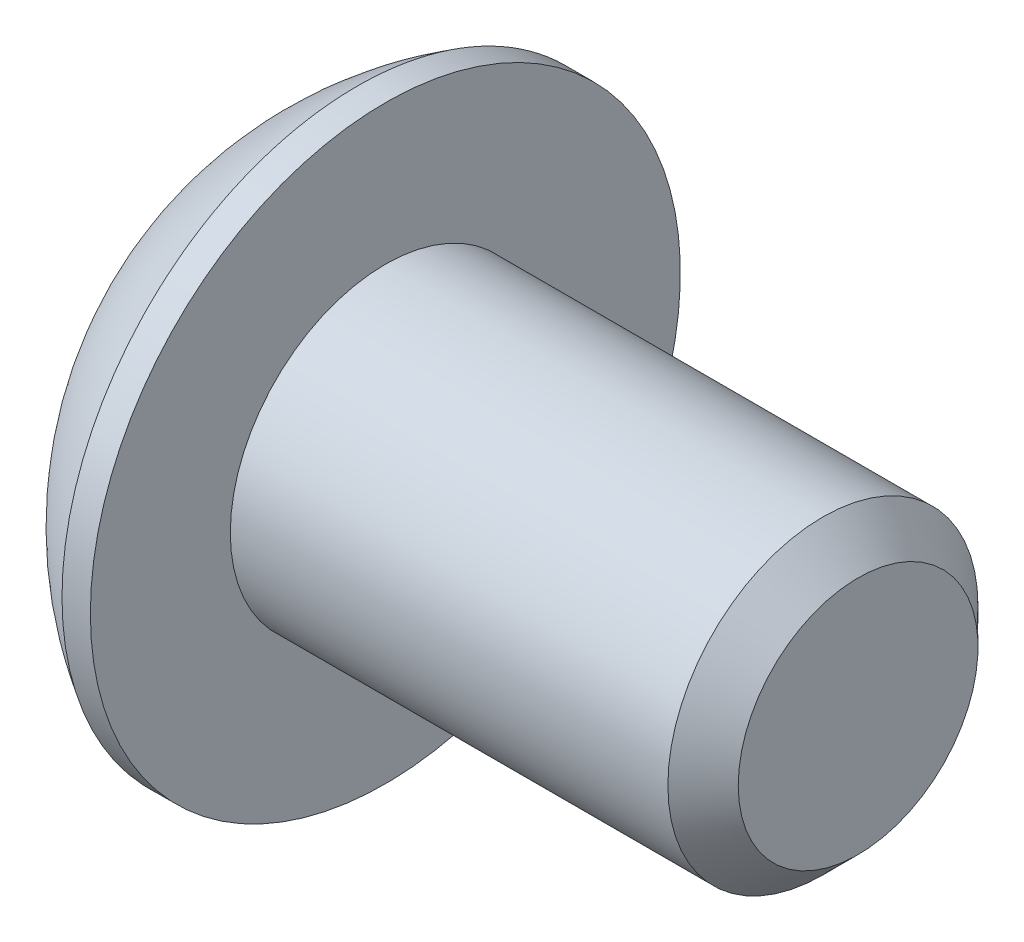
ISO-10303-21;
HEADER;
FILE_DESCRIPTION(('STEP AP214'),'2;1');
FILE_NAME('part.step','',(''),(''),'','','');
FILE_SCHEMA(('AUTOMOTIVE_DESIGN { 1 0 10303 214 1 1 1 1 }'));
ENDSEC;
DATA;
#1=APPLICATION_CONTEXT('core data for automotive mechanical design processes');
#2=APPLICATION_PROTOCOL_DEFINITION('international standard','automotive_design',2000,#1);
#3=PRODUCT_CONTEXT('',#1,'mechanical');
#4=PRODUCT('Part','Part','',(#3));
#5=PRODUCT_RELATED_PRODUCT_CATEGORY('part','',(#4));
#6=PRODUCT_DEFINITION_FORMATION('','',#4);
#7=PRODUCT_DEFINITION_CONTEXT('part definition',#1,'design');
#8=PRODUCT_DEFINITION('design','',#6,#7);
#9=PRODUCT_DEFINITION_SHAPE('','',#8);
#10=(LENGTH_UNIT() NAMED_UNIT(*) SI_UNIT(.MILLI.,.METRE.));
#11=(NAMED_UNIT(*) PLANE_ANGLE_UNIT() SI_UNIT($,.RADIAN.));
#12=(NAMED_UNIT(*) SI_UNIT($,.STERADIAN.) SOLID_ANGLE_UNIT());
#13=UNCERTAINTY_MEASURE_WITH_UNIT(LENGTH_MEASURE(1.E-05),#10,'distance_accuracy_value','');
#14=(GEOMETRIC_REPRESENTATION_CONTEXT(3) GLOBAL_UNCERTAINTY_ASSIGNED_CONTEXT((#13)) GLOBAL_UNIT_ASSIGNED_CONTEXT((#10,
#11,#12)) REPRESENTATION_CONTEXT('',''));
#15=CARTESIAN_POINT('',(0.,0.,0.));
#16=DIRECTION('',(0.,0.,1.));
#17=DIRECTION('',(1.,0.,0.));
#18=AXIS2_PLACEMENT_3D('',#15,#16,#17);
#19=CARTESIAN_POINT('',(1.32080000000034,0.,0.));
#20=DIRECTION('',(-1.,0.,0.));
#21=DIRECTION('',(0.,0.,1.));
#22=AXIS2_PLACEMENT_3D('',#19,#20,#21);
#23=CONICAL_SURFACE('',#22,1.1937999999998,1.04719755119608);
#24=CARTESIAN_POINT('',(2.01004075135902,0.,4.44089209850063E-13));
#25=VERTEX_POINT('',#24);
#26=VERTEX_LOOP('',#25);
#27=FACE_BOUND('',#26,.T.);
#28=CARTESIAN_POINT('',(1.32080000000009,0.,0.));
#29=DIRECTION('',(-1.,0.,0.));
#30=DIRECTION('',(0.,0.,1.));
#31=AXIS2_PLACEMENT_3D('',#28,#29,#30);
#32=CIRCLE('',#31,1.19380000000024);
#33=CARTESIAN_POINT('',(1.32080000000004,-1.03386112703797,0.59690000000006));
#34=VERTEX_POINT('',#33);
#35=CARTESIAN_POINT('',(1.32080000000004,0.,1.19380000000012));
#36=VERTEX_POINT('',#35);
#37=EDGE_CURVE('E20',#34,#36,#32,.T.);
#38=ORIENTED_EDGE('',*,*,#37,.T.);
#39=CARTESIAN_POINT('',(1.32080000000009,0.,0.));
#40=DIRECTION('',(-1.,0.,0.));
#41=DIRECTION('',(0.,0.,1.));
#42=AXIS2_PLACEMENT_3D('',#39,#40,#41);
#43=CIRCLE('',#42,1.19380000000024);
#44=CARTESIAN_POINT('',(1.32080000000004,1.03386112703797,0.596900000000061));
#45=VERTEX_POINT('',#44);
#46=EDGE_CURVE('E148',#36,#45,#43,.T.);
#47=ORIENTED_EDGE('',*,*,#46,.T.);
#48=CARTESIAN_POINT('',(1.32080000000009,0.,0.));
#49=DIRECTION('',(-1.,0.,0.));
#50=DIRECTION('',(0.,0.,1.));
#51=AXIS2_PLACEMENT_3D('',#48,#49,#50);
#52=CIRCLE('',#51,1.19380000000024);
#53=CARTESIAN_POINT('',(1.32080000000004,1.03386112703797,-0.596900000000061));
#54=VERTEX_POINT('',#53);
#55=EDGE_CURVE('E448',#45,#54,#52,.T.);
#56=ORIENTED_EDGE('',*,*,#55,.T.);
#57=CARTESIAN_POINT('',(1.32080000000009,0.,0.));
#58=DIRECTION('',(-1.,0.,0.));
#59=DIRECTION('',(0.,0.,1.));
#60=AXIS2_PLACEMENT_3D('',#57,#58,#59);
#61=CIRCLE('',#60,1.19380000000024);
#62=CARTESIAN_POINT('',(1.32080000000004,1.49457637585666E-12,-1.19380000000012));
#63=VERTEX_POINT('',#62);
#64=EDGE_CURVE('E449',#54,#63,#61,.T.);
#65=ORIENTED_EDGE('',*,*,#64,.T.);
#66=CARTESIAN_POINT('',(1.32080000000009,0.,0.));
#67=DIRECTION('',(-1.,0.,0.));
#68=DIRECTION('',(0.,0.,1.));
#69=AXIS2_PLACEMENT_3D('',#66,#67,#68);
#70=CIRCLE('',#69,1.19380000000024);
#71=CARTESIAN_POINT('',(1.32080000000004,-1.03386112703797,-0.59690000000006));
#72=VERTEX_POINT('',#71);
#73=EDGE_CURVE('E93',#63,#72,#70,.T.);
#74=ORIENTED_EDGE('',*,*,#73,.T.);
#75=CARTESIAN_POINT('',(1.32080000000009,0.,0.));
#76=DIRECTION('',(-1.,0.,0.));
#77=DIRECTION('',(0.,0.,1.));
#78=AXIS2_PLACEMENT_3D('',#75,#76,#77);
#79=CIRCLE('',#78,1.19380000000024);
#80=EDGE_CURVE('E89',#72,#34,#79,.T.);
#81=ORIENTED_EDGE('',*,*,#80,.T.);
#82=EDGE_LOOP('',(#38,#47,#56,#65,#74,#81));
#83=FACE_BOUND('',#82,.T.);
#84=ADVANCED_FACE('F17',(#27,#83),#23,.F.);
#85=CARTESIAN_POINT('',(1.3208,-2.06772225407572,-1.1938));
#86=DIRECTION('',(1.,0.,0.));
#87=DIRECTION('',(0.,0.,-1.));
#88=AXIS2_PLACEMENT_3D('',#85,#86,#87);
#89=PLANE('',#88);
#90=DIRECTION('',(0.,0.5,0.866025403784439));
#91=VECTOR('',#90,1.);
#92=CARTESIAN_POINT('',(1.3208,-1.37848150271715,0.));
#93=LINE('',#92,#91);
#94=CARTESIAN_POINT('',(1.3208,-0.689240751358574,1.1938));
#95=VERTEX_POINT('',#94);
#96=EDGE_CURVE('E101',#95,#34,#93,.F.);
#97=ORIENTED_EDGE('',*,*,#96,.F.);
#98=DIRECTION('',(0.,1.,0.));
#99=VECTOR('',#98,1.);
#100=CARTESIAN_POINT('',(1.3208,-0.689240751358574,1.1938));
#101=LINE('',#100,#99);
#102=EDGE_CURVE('E103',#36,#95,#101,.F.);
#103=ORIENTED_EDGE('',*,*,#102,.F.);
#104=ORIENTED_EDGE('',*,*,#37,.F.);
#105=EDGE_LOOP('',(#97,#103,#104));
#106=FACE_BOUND('',#105,.T.);
#107=ADVANCED_FACE('F99',(#106),#89,.F.);
#108=CARTESIAN_POINT('',(1.3208,-2.06772225407572,-1.1938));
#109=DIRECTION('',(1.,0.,0.));
#110=DIRECTION('',(0.,0.,-1.));
#111=AXIS2_PLACEMENT_3D('',#108,#109,#110);
#112=PLANE('',#111);
#113=DIRECTION('',(0.,-0.5,0.866025403784439));
#114=VECTOR('',#113,1.);
#115=CARTESIAN_POINT('',(1.3208,-0.689240751358574,-1.1938));
#116=LINE('',#115,#114);
#117=CARTESIAN_POINT('',(1.3208,-1.37848150271715,0.));
#118=VERTEX_POINT('',#117);
#119=EDGE_CURVE('E109',#118,#72,#116,.F.);
#120=ORIENTED_EDGE('',*,*,#119,.F.);
#121=DIRECTION('',(0.,0.5,0.866025403784439));
#122=VECTOR('',#121,1.);
#123=CARTESIAN_POINT('',(1.3208,-1.37848150271715,0.));
#124=LINE('',#123,#122);
#125=EDGE_CURVE('E106',#34,#118,#124,.F.);
#126=ORIENTED_EDGE('',*,*,#125,.F.);
#127=ORIENTED_EDGE('',*,*,#80,.F.);
#128=EDGE_LOOP('',(#120,#126,#127));
#129=FACE_BOUND('',#128,.T.);
#130=ADVANCED_FACE('F107',(#129),#112,.F.);
#131=CARTESIAN_POINT('',(1.3208,-2.06772225407572,-1.1938));
#132=DIRECTION('',(1.,0.,0.));
#133=DIRECTION('',(0.,0.,-1.));
#134=AXIS2_PLACEMENT_3D('',#131,#132,#133);
#135=PLANE('',#134);
#136=DIRECTION('',(0.,1.,0.));
#137=VECTOR('',#136,1.);
#138=CARTESIAN_POINT('',(1.3208,0.689240751358577,-1.1938));
#139=LINE('',#138,#137);
#140=CARTESIAN_POINT('',(1.3208,-0.689240751358574,-1.1938));
#141=VERTEX_POINT('',#140);
#142=EDGE_CURVE('E419',#141,#63,#139,.T.);
#143=ORIENTED_EDGE('',*,*,#142,.F.);
#144=DIRECTION('',(0.,-0.5,0.866025403784439));
#145=VECTOR('',#144,1.);
#146=CARTESIAN_POINT('',(1.3208,-0.689240751358574,-1.1938));
#147=LINE('',#146,#145);
#148=EDGE_CURVE('E431',#72,#141,#147,.F.);
#149=ORIENTED_EDGE('',*,*,#148,.F.);
#150=ORIENTED_EDGE('',*,*,#73,.F.);
#151=EDGE_LOOP('',(#143,#149,#150));
#152=FACE_BOUND('',#151,.T.);
#153=ADVANCED_FACE('F191',(#152),#135,.F.);
#154=CARTESIAN_POINT('',(1.3208,-2.06772225407572,-1.1938));
#155=DIRECTION('',(1.,0.,0.));
#156=DIRECTION('',(0.,0.,-1.));
#157=AXIS2_PLACEMENT_3D('',#154,#155,#156);
#158=PLANE('',#157);
#159=DIRECTION('',(0.,-0.5,-0.866025403784439));
#160=VECTOR('',#159,1.);
#161=CARTESIAN_POINT('',(1.3208,1.37848150271715,0.));
#162=LINE('',#161,#160);
#163=CARTESIAN_POINT('',(1.3208,0.689240751358577,-1.1938));
#164=VERTEX_POINT('',#163);
#165=EDGE_CURVE('E405',#164,#54,#162,.F.);
#166=ORIENTED_EDGE('',*,*,#165,.F.);
#167=DIRECTION('',(0.,1.,0.));
#168=VECTOR('',#167,1.);
#169=CARTESIAN_POINT('',(1.3208,0.689240751358577,-1.1938));
#170=LINE('',#169,#168);
#171=EDGE_CURVE('E416',#63,#164,#170,.T.);
#172=ORIENTED_EDGE('',*,*,#171,.F.);
#173=ORIENTED_EDGE('',*,*,#64,.F.);
#174=EDGE_LOOP('',(#166,#172,#173));
#175=FACE_BOUND('',#174,.T.);
#176=ADVANCED_FACE('F187',(#175),#158,.F.);
#177=CARTESIAN_POINT('',(1.3208,-2.06772225407572,-1.1938));
#178=DIRECTION('',(1.,0.,0.));
#179=DIRECTION('',(0.,0.,-1.));
#180=AXIS2_PLACEMENT_3D('',#177,#178,#179);
#181=PLANE('',#180);
#182=DIRECTION('',(0.,0.5,-0.866025403784439));
#183=VECTOR('',#182,1.);
#184=CARTESIAN_POINT('',(1.3208,0.689240751358576,1.1938));
#185=LINE('',#184,#183);
#186=CARTESIAN_POINT('',(1.3208,1.37848150271715,0.));
#187=VERTEX_POINT('',#186);
#188=EDGE_CURVE('E384',#187,#45,#185,.F.);
#189=ORIENTED_EDGE('',*,*,#188,.F.);
#190=DIRECTION('',(0.,-0.5,-0.866025403784439));
#191=VECTOR('',#190,1.);
#192=CARTESIAN_POINT('',(1.3208,1.37848150271715,0.));
#193=LINE('',#192,#191);
#194=EDGE_CURVE('E403',#54,#187,#193,.F.);
#195=ORIENTED_EDGE('',*,*,#194,.F.);
#196=ORIENTED_EDGE('',*,*,#55,.F.);
#197=EDGE_LOOP('',(#189,#195,#196));
#198=FACE_BOUND('',#197,.T.);
#199=ADVANCED_FACE('F183',(#198),#181,.F.);
#200=CARTESIAN_POINT('',(1.3208,-2.06772225407572,-1.1938));
#201=DIRECTION('',(1.,0.,0.));
#202=DIRECTION('',(0.,0.,-1.));
#203=AXIS2_PLACEMENT_3D('',#200,#201,#202);
#204=PLANE('',#203);
#205=DIRECTION('',(0.,1.,0.));
#206=VECTOR('',#205,1.);
#207=CARTESIAN_POINT('',(1.3208,-0.689240751358574,1.1938));
#208=LINE('',#207,#206);
#209=CARTESIAN_POINT('',(1.3208,0.689240751358576,1.1938));
#210=VERTEX_POINT('',#209);
#211=EDGE_CURVE('E118',#210,#36,#208,.F.);
#212=ORIENTED_EDGE('',*,*,#211,.F.);
#213=DIRECTION('',(0.,0.5,-0.866025403784439));
#214=VECTOR('',#213,1.);
#215=CARTESIAN_POINT('',(1.3208,0.689240751358576,1.1938));
#216=LINE('',#215,#214);
#217=EDGE_CURVE('E387',#45,#210,#216,.F.);
#218=ORIENTED_EDGE('',*,*,#217,.F.);
#219=ORIENTED_EDGE('',*,*,#46,.F.);
#220=EDGE_LOOP('',(#212,#218,#219));
#221=FACE_BOUND('',#220,.T.);
#222=ADVANCED_FACE('F179',(#221),#204,.F.);
#223=CARTESIAN_POINT('',(1.3208,-0.689240751358574,1.1938));
#224=DIRECTION('',(0.,0.,-1.));
#225=DIRECTION('',(0.,1.,0.));
#226=AXIS2_PLACEMENT_3D('',#223,#224,#225);
#227=PLANE('',#226);
#228=DIRECTION('',(0.,1.,0.));
#229=VECTOR('',#228,1.);
#230=CARTESIAN_POINT('',(0.,0.,1.1938));
#231=LINE('',#230,#229);
#232=CARTESIAN_POINT('',(0.,0.689240751358577,1.1938));
#233=VERTEX_POINT('',#232);
#234=CARTESIAN_POINT('',(0.,-0.689240751358574,1.1938));
#235=VERTEX_POINT('',#234);
#236=EDGE_CURVE('E381',#233,#235,#231,.F.);
#237=ORIENTED_EDGE('',*,*,#236,.F.);
#238=DIRECTION('',(1.,0.,0.));
#239=VECTOR('',#238,1.);
#240=CARTESIAN_POINT('',(1.3208,0.689240751358576,1.1938));
#241=LINE('',#240,#239);
#242=EDGE_CURVE('E393',#210,#233,#241,.F.);
#243=ORIENTED_EDGE('',*,*,#242,.F.);
#244=ORIENTED_EDGE('',*,*,#211,.T.);
#245=ORIENTED_EDGE('',*,*,#102,.T.);
#246=DIRECTION('',(1.,0.,0.));
#247=VECTOR('',#246,1.);
#248=CARTESIAN_POINT('',(1.3208,-0.689240751358574,1.1938));
#249=LINE('',#248,#247);
#250=EDGE_CURVE('E112',#235,#95,#249,.T.);
#251=ORIENTED_EDGE('',*,*,#250,.F.);
#252=EDGE_LOOP('',(#237,#243,#244,#245,#251));
#253=FACE_BOUND('',#252,.T.);
#254=ADVANCED_FACE('F176',(#253),#227,.T.);
#255=CARTESIAN_POINT('',(1.3208,-1.37848150271715,0.));
#256=DIRECTION('',(0.,0.866025403784439,-0.5));
#257=DIRECTION('',(0.,0.5,0.866025403784439));
#258=AXIS2_PLACEMENT_3D('',#255,#256,#257);
#259=PLANE('',#258);
#260=DIRECTION('',(0.,-0.5,-0.866025403784439));
#261=VECTOR('',#260,1.);
#262=CARTESIAN_POINT('',(0.,-0.689240751358574,1.1938));
#263=LINE('',#262,#261);
#264=CARTESIAN_POINT('',(0.,-1.37848150271715,0.));
#265=VERTEX_POINT('',#264);
#266=EDGE_CURVE('E378',#235,#265,#263,.T.);
#267=ORIENTED_EDGE('',*,*,#266,.F.);
#268=ORIENTED_EDGE('',*,*,#250,.T.);
#269=ORIENTED_EDGE('',*,*,#96,.T.);
#270=ORIENTED_EDGE('',*,*,#125,.T.);
#271=DIRECTION('',(1.,0.,0.));
#272=VECTOR('',#271,1.);
#273=CARTESIAN_POINT('',(1.3208,-1.37848150271715,0.));
#274=LINE('',#273,#272);
#275=EDGE_CURVE('E428',#265,#118,#274,.T.);
#276=ORIENTED_EDGE('',*,*,#275,.F.);
#277=EDGE_LOOP('',(#267,#268,#269,#270,#276));
#278=FACE_BOUND('',#277,.T.);
#279=ADVANCED_FACE('F116',(#278),#259,.T.);
#280=CARTESIAN_POINT('',(1.3208,-0.689240751358574,-1.1938));
#281=DIRECTION('',(0.,0.866025403784439,0.5));
#282=DIRECTION('',(0.,-0.5,0.866025403784439));
#283=AXIS2_PLACEMENT_3D('',#280,#281,#282);
#284=PLANE('',#283);
#285=DIRECTION('',(0.,0.5,-0.866025403784439));
#286=VECTOR('',#285,1.);
#287=CARTESIAN_POINT('',(0.,-1.37848150271715,0.));
#288=LINE('',#287,#286);
#289=CARTESIAN_POINT('',(0.,-0.689240751358574,-1.1938));
#290=VERTEX_POINT('',#289);
#291=EDGE_CURVE('E375',#265,#290,#288,.T.);
#292=ORIENTED_EDGE('',*,*,#291,.F.);
#293=ORIENTED_EDGE('',*,*,#275,.T.);
#294=ORIENTED_EDGE('',*,*,#119,.T.);
#295=ORIENTED_EDGE('',*,*,#148,.T.);
#296=DIRECTION('',(1.,0.,0.));
#297=VECTOR('',#296,1.);
#298=CARTESIAN_POINT('',(1.3208,-0.689240751358574,-1.1938));
#299=LINE('',#298,#297);
#300=EDGE_CURVE('E413',#290,#141,#299,.T.);
#301=ORIENTED_EDGE('',*,*,#300,.F.);
#302=EDGE_LOOP('',(#292,#293,#294,#295,#301));
#303=FACE_BOUND('',#302,.T.);
#304=ADVANCED_FACE('F169',(#303),#284,.T.);
#305=CARTESIAN_POINT('',(1.3208,0.689240751358577,-1.1938));
#306=DIRECTION('',(0.,0.,1.));
#307=DIRECTION('',(1.,0.,0.));
#308=AXIS2_PLACEMENT_3D('',#305,#306,#307);
#309=PLANE('',#308);
#310=DIRECTION('',(0.,1.,0.));
#311=VECTOR('',#310,1.);
#312=CARTESIAN_POINT('',(0.,0.,-1.1938));
#313=LINE('',#312,#311);
#314=CARTESIAN_POINT('',(0.,0.689240751358577,-1.1938));
#315=VERTEX_POINT('',#314);
#316=EDGE_CURVE('E372',#290,#315,#313,.T.);
#317=ORIENTED_EDGE('',*,*,#316,.F.);
#318=ORIENTED_EDGE('',*,*,#300,.T.);
#319=ORIENTED_EDGE('',*,*,#142,.T.);
#320=ORIENTED_EDGE('',*,*,#171,.T.);
#321=DIRECTION('',(1.,0.,0.));
#322=VECTOR('',#321,1.);
#323=CARTESIAN_POINT('',(1.3208,0.689240751358577,-1.1938));
#324=LINE('',#323,#322);
#325=EDGE_CURVE('E388',#315,#164,#324,.T.);
#326=ORIENTED_EDGE('',*,*,#325,.F.);
#327=EDGE_LOOP('',(#317,#318,#319,#320,#326));
#328=FACE_BOUND('',#327,.T.);
#329=ADVANCED_FACE('F166',(#328),#309,.T.);
#330=CARTESIAN_POINT('',(1.3208,1.37848150271715,0.));
#331=DIRECTION('',(0.,-0.866025403784439,0.5));
#332=DIRECTION('',(0.,-0.5,-0.866025403784439));
#333=AXIS2_PLACEMENT_3D('',#330,#331,#332);
#334=PLANE('',#333);
#335=DIRECTION('',(0.,0.5,0.866025403784439));
#336=VECTOR('',#335,1.);
#337=CARTESIAN_POINT('',(0.,0.689240751358577,-1.1938));
#338=LINE('',#337,#336);
#339=CARTESIAN_POINT('',(0.,1.37848150271715,0.));
#340=VERTEX_POINT('',#339);
#341=EDGE_CURVE('E369',#315,#340,#338,.T.);
#342=ORIENTED_EDGE('',*,*,#341,.F.);
#343=ORIENTED_EDGE('',*,*,#325,.T.);
#344=ORIENTED_EDGE('',*,*,#165,.T.);
#345=ORIENTED_EDGE('',*,*,#194,.T.);
#346=DIRECTION('',(1.,0.,0.));
#347=VECTOR('',#346,1.);
#348=CARTESIAN_POINT('',(1.3208,1.37848150271715,0.));
#349=LINE('',#348,#347);
#350=EDGE_CURVE('E35',#340,#187,#349,.T.);
#351=ORIENTED_EDGE('',*,*,#350,.F.);
#352=EDGE_LOOP('',(#342,#343,#344,#345,#351));
#353=FACE_BOUND('',#352,.T.);
#354=ADVANCED_FACE('F162',(#353),#334,.T.);
#355=CARTESIAN_POINT('',(1.3208,0.689240751358576,1.1938));
#356=DIRECTION('',(0.,-0.866025403784439,-0.5));
#357=DIRECTION('',(0.,0.5,-0.866025403784439));
#358=AXIS2_PLACEMENT_3D('',#355,#356,#357);
#359=PLANE('',#358);
#360=DIRECTION('',(0.,-0.5,0.866025403784439));
#361=VECTOR('',#360,1.);
#362=CARTESIAN_POINT('',(0.,1.37848150271715,0.));
#363=LINE('',#362,#361);
#364=EDGE_CURVE('E147',#340,#233,#363,.T.);
#365=ORIENTED_EDGE('',*,*,#364,.F.);
#366=ORIENTED_EDGE('',*,*,#350,.T.);
#367=ORIENTED_EDGE('',*,*,#188,.T.);
#368=ORIENTED_EDGE('',*,*,#217,.T.);
#369=ORIENTED_EDGE('',*,*,#242,.T.);
#370=EDGE_LOOP('',(#365,#366,#367,#368,#369));
#371=FACE_BOUND('',#370,.T.);
#372=ADVANCED_FACE('F158',(#371),#359,.T.);
#373=CARTESIAN_POINT('',(0.,0.,0.));
#374=DIRECTION('',(-1.,0.,0.));
#375=DIRECTION('',(0.,0.,1.));
#376=AXIS2_PLACEMENT_3D('',#373,#374,#375);
#377=PLANE('',#376);
#378=ORIENTED_EDGE('',*,*,#341,.T.);
#379=ORIENTED_EDGE('',*,*,#364,.T.);
#380=ORIENTED_EDGE('',*,*,#236,.T.);
#381=ORIENTED_EDGE('',*,*,#266,.T.);
#382=ORIENTED_EDGE('',*,*,#291,.T.);
#383=ORIENTED_EDGE('',*,*,#316,.T.);
#384=EDGE_LOOP('',(#378,#379,#380,#381,#382,#383));
#385=FACE_BOUND('',#384,.T.);
#386=CARTESIAN_POINT('',(0.,1.9812,0.));
#387=CARTESIAN_POINT('',(0.,1.9811996664299,0.0556258831179428));
#388=CARTESIAN_POINT('',(0.,1.97885520380442,0.111261989398606));
#389=CARTESIAN_POINT('',(0.,1.96949260169541,0.222149719830458));
#390=CARTESIAN_POINT('',(0.,1.96247308239605,0.277401225602895));
#391=CARTESIAN_POINT('',(0.,1.94379192841038,0.387209508139747));
#392=CARTESIAN_POINT('',(-1.85325793235264E-13,1.93212292489526,0.441765039546365));
#393=CARTESIAN_POINT('',(1.86344214223505E-13,1.90422331175315,0.549729449347493));
#394=CARTESIAN_POINT('',(6.94543371897454E-13,1.88798900035338,0.603137359208869));
#395=CARTESIAN_POINT('',(1.15501975216981E-12,1.83266214476501,0.760839131321828));
#396=CARTESIAN_POINT('',(0.,1.78690023648845,0.862876433575429));
#397=CARTESIAN_POINT('',(0.,1.67887358150667,1.05780719540872));
#398=CARTESIAN_POINT('',(9.54193214892627E-13,1.6166082074585,1.15070030720801));
#399=CARTESIAN_POINT('',(5.94805591894675E-13,1.51224157140982,1.28116890915697));
#400=CARTESIAN_POINT('',(1.63221293851378E-13,1.4755970394354,1.32320451127026));
#401=CARTESIAN_POINT('',(-1.62196980336157E-13,1.39893832619713,1.40400288695709));
#402=CARTESIAN_POINT('',(0.,1.35892742784698,1.44276877695455));
#403=CARTESIAN_POINT('',(1.14362537325405E-13,1.23416504602197,1.55382272417904));
#404=CARTESIAN_POINT('',(0.,1.14466125559859,1.62089527952111));
#405=CARTESIAN_POINT('',(0.,0.955712144178167,1.7390221808118));
#406=CARTESIAN_POINT('',(0.,0.856267198233564,1.79007713076007));
#407=CARTESIAN_POINT('',(0.,0.650206345910843,1.87477637530954));
#408=CARTESIAN_POINT('',(0.,0.543590516134855,1.90842085586267));
#409=CARTESIAN_POINT('',(0.,0.326226155292018,1.95733039300656));
#410=CARTESIAN_POINT('',(0.,0.21547760215793,1.97259535144288));
#411=CARTESIAN_POINT('',(0.,-0.00701040587544639,1.98431697865418));
#412=CARTESIAN_POINT('',(0.,-0.118749860774734,1.98077364742917));
#413=CARTESIAN_POINT('',(0.,-0.340050178355485,1.95497485623825));
#414=CARTESIAN_POINT('',(0.,-0.449611052668255,1.93271949620218));
#415=CARTESIAN_POINT('',(0.,-0.663431110729174,1.87014138774523));
#416=CARTESIAN_POINT('',(0.,-0.76769023783852,1.82981844635272));
#417=CARTESIAN_POINT('',(0.,-0.968005760719347,1.73219968377096));
#418=CARTESIAN_POINT('',(0.,-1.0640618469811,1.6749032225164));
#419=CARTESIAN_POINT('',(0.,-1.19980276751283,1.57757371205873));
#420=CARTESIAN_POINT('',(0.,-1.24366557129213,1.54322665019466));
#421=CARTESIAN_POINT('',(0.,-1.32838995706696,1.47093063174264));
#422=CARTESIAN_POINT('',(0.,-1.36924860178706,1.43297823102439));
#423=CARTESIAN_POINT('',(0.,-1.48674671849223,1.31419842051173));
#424=CARTESIAN_POINT('',(0.,-1.55842832343237,1.22836221289311));
#425=CARTESIAN_POINT('',(0.,-1.6863396856475,1.04586168272493));
#426=CARTESIAN_POINT('',(0.,-1.7425700302488,0.949197771949774));
#427=CARTESIAN_POINT('',(0.,-1.8141614250401,0.798182600298684));
#428=CARTESIAN_POINT('',(0.,-1.83591780585875,0.746776203847791));
#429=CARTESIAN_POINT('',(0.,-1.87500754181092,0.642341081688636));
#430=CARTESIAN_POINT('',(0.,-1.89234447645404,0.589313708122847));
#431=CARTESIAN_POINT('',(0.,-1.92246053433554,0.482076273028395));
#432=CARTESIAN_POINT('',(0.,-1.93524685475118,0.42786822425751));
#433=CARTESIAN_POINT('',(0.,-1.95620937250494,0.318578151844611));
#434=CARTESIAN_POINT('',(0.,-1.96438692958147,0.263496390912872));
#435=CARTESIAN_POINT('',(0.,-1.97388528284653,0.173607715038558));
#436=CARTESIAN_POINT('',(0.,-1.97662743364426,0.138944718024998));
#437=CARTESIAN_POINT('',(0.,-1.98028489645283,0.0695224782567002));
#438=CARTESIAN_POINT('',(0.,-1.98120020846367,0.0347632355019631));
#439=CARTESIAN_POINT('',(0.,-1.9811996664299,-0.0556258831179437));
#440=CARTESIAN_POINT('',(0.,-1.97885520380442,-0.111261989398607));
#441=CARTESIAN_POINT('',(0.,-1.96949260169541,-0.222149719830459));
#442=CARTESIAN_POINT('',(0.,-1.96247308239605,-0.277401225602897));
#443=CARTESIAN_POINT('',(0.,-1.94379192841039,-0.387209508139749));
#444=CARTESIAN_POINT('',(-1.85269749640691E-13,-1.93212292489526,-0.441765039546367));
#445=CARTESIAN_POINT('',(1.86288125054388E-13,-1.90422331175315,-0.549729449347495));
#446=CARTESIAN_POINT('',(6.94525090263764E-13,-1.88798900035338,-0.603137359208872));
#447=CARTESIAN_POINT('',(1.15505622829081E-12,-1.83266214476501,-0.760839131321831));
#448=CARTESIAN_POINT('',(0.,-1.78690023648845,-0.862876433575431));
#449=CARTESIAN_POINT('',(0.,-1.67887358150667,-1.05780719540872));
#450=CARTESIAN_POINT('',(9.54248812869379E-13,-1.6166082074585,-1.15070030720801));
#451=CARTESIAN_POINT('',(5.94777756479239E-13,-1.51224157140982,-1.28116890915698));
#452=CARTESIAN_POINT('',(1.63138949183833E-13,-1.47559703943539,-1.32320451127027));
#453=CARTESIAN_POINT('',(-1.62114715061273E-13,-1.39893832619713,-1.40400288695709));
#454=CARTESIAN_POINT('',(0.,-1.35892742784699,-1.44276877695455));
#455=CARTESIAN_POINT('',(1.13760489124207E-13,-1.23416504602197,-1.55382272417904));
#456=CARTESIAN_POINT('',(0.,-1.14466125559859,-1.62089527952111));
#457=CARTESIAN_POINT('',(0.,-0.95571214417816,-1.73902218081179));
#458=CARTESIAN_POINT('',(0.,-0.856267198233559,-1.79007713076007));
#459=CARTESIAN_POINT('',(0.,-0.650206345910841,-1.87477637530954));
#460=CARTESIAN_POINT('',(0.,-0.543590516134854,-1.90842085586267));
#461=CARTESIAN_POINT('',(0.,-0.326226155292018,-1.95733039300657));
#462=CARTESIAN_POINT('',(0.,-0.215477602157929,-1.97259535144288));
#463=CARTESIAN_POINT('',(0.,0.0070104058754487,-1.98431697865418));
#464=CARTESIAN_POINT('',(0.,0.118749860774737,-1.98077364742916));
#465=CARTESIAN_POINT('',(0.,0.340050178355489,-1.95497485623824));
#466=CARTESIAN_POINT('',(0.,0.44961105266826,-1.93271949620218));
#467=CARTESIAN_POINT('',(0.,0.663431110729178,-1.87014138774524));
#468=CARTESIAN_POINT('',(0.,0.767690237838524,-1.82981844635272));
#469=CARTESIAN_POINT('',(0.,0.968005760719348,-1.73219968377096));
#470=CARTESIAN_POINT('',(0.,1.0640618469811,-1.67490322251639));
#471=CARTESIAN_POINT('',(0.,1.19980276751283,-1.57757371205873));
#472=CARTESIAN_POINT('',(0.,1.24366557129214,-1.54322665019465));
#473=CARTESIAN_POINT('',(0.,1.32838995706696,-1.47093063174263));
#474=CARTESIAN_POINT('',(0.,1.36924860178706,-1.43297823102439));
#475=CARTESIAN_POINT('',(0.,1.48674671849223,-1.31419842051172));
#476=CARTESIAN_POINT('',(0.,1.55842832343237,-1.22836221289311));
#477=CARTESIAN_POINT('',(0.,1.6863396856475,-1.04586168272492));
#478=CARTESIAN_POINT('',(0.,1.7425700302488,-0.949197771949768));
#479=CARTESIAN_POINT('',(0.,1.8141614250401,-0.798182600298677));
#480=CARTESIAN_POINT('',(0.,1.83591780585875,-0.746776203847785));
#481=CARTESIAN_POINT('',(0.,1.87500754181092,-0.64234108168863));
#482=CARTESIAN_POINT('',(0.,1.89234447645404,-0.589313708122841));
#483=CARTESIAN_POINT('',(0.,1.92246053433555,-0.482076273028389));
#484=CARTESIAN_POINT('',(0.,1.93524685475118,-0.427868224257505));
#485=CARTESIAN_POINT('',(0.,1.95620937250494,-0.318578151844605));
#486=CARTESIAN_POINT('',(0.,1.96438692958147,-0.263496390912866));
#487=CARTESIAN_POINT('',(0.,1.97388528284653,-0.173607715038553));
#488=CARTESIAN_POINT('',(0.,1.97662743364426,-0.138944718024994));
#489=CARTESIAN_POINT('',(0.,1.98028489645283,-0.0695224782566989));
#490=CARTESIAN_POINT('',(0.,1.98120020846367,-0.034763235501963));
#491=CARTESIAN_POINT('',(0.,1.9812,0.));
#492=B_SPLINE_CURVE_WITH_KNOTS('',3,(#386,#387,#388,#389,#390,#391,#392,#393,#394,#395,#396,
#397,#398,#399,#400,#401,#402,#403,#404,#405,#406,#407,#408,#409,#410,#411,#412,#413,#414,#415,
#416,#417,#418,#419,#420,#421,#422,#423,#424,#425,#426,#427,#428,#429,#430,#431,#432,#433,#434,
#435,#436,#437,#438,#439,#440,#441,#442,#443,#444,#445,#446,#447,#448,#449,#450,#451,#452,#453,
#454,#455,#456,#457,#458,#459,#460,#461,#462,#463,#464,#465,#466,#467,#468,#469,#470,#471,#472,
#473,#474,#475,#476,#477,#478,#479,#480,#481,#482,#483,#484,#485,#486,#487,#488,#489,#490,#491),
.UNSPECIFIED.,.T.,.F.,(4,2,2,2,2,2,2,2,2,2,2,2,2,2,2,2,2,2,2,2,2,2,2,2,2,2,2,2,2,2,2,2,2,2,2,2,
2,2,2,2,2,2,2,2,2,2,2,2,2,2,2,2,4),(0.,0.166845646007828,0.333740557374255,0.500901034367693,
0.668197445942386,1.00199278686282,1.33580081809885,1.50292354032982,1.6698851310853,
2.00370118900129,2.33750465770544,2.67130456115909,3.005106247238,3.33890793331696,
3.67270783677065,4.00651130547476,4.34032736339026,4.50728895414554,4.67441167637632,
5.00821970761259,5.34201504853332,5.50931146010827,5.67647193710191,5.84336684846844,
6.0102124944764,6.11448220058334,6.21875190669029,6.38559755269812,6.55249246406454,
6.71965294105798,6.88694935263268,7.22074469355311,7.55455272478915,7.72167544702011,
7.88863703777559,8.22245309569158,8.55625656439573,8.89005646784938,9.2238581539283,
9.55765984000725,9.89145974346094,10.2252632121651,10.5590792700806,10.7260408608358,
10.8931635830666,11.2269716143029,11.5607669552236,11.7280633667986,11.8952238437922,
12.0621187551587,12.2289644011667,12.3332341072736,12.4375038133806),.UNSPECIFIED.);
#493=CARTESIAN_POINT('',(0.,1.9812,0.));
#494=VERTEX_POINT('',#493);
#495=EDGE_CURVE('E140',#494,#494,#492,.T.);
#496=ORIENTED_EDGE('',*,*,#495,.F.);
#497=EDGE_LOOP('',(#496));
#498=FACE_BOUND('',#497,.T.);
#499=ADVANCED_FACE('F154',(#385,#498),#377,.T.);
#500=CARTESIAN_POINT('',(4.13385,0.,0.));
#501=DIRECTION('',(0.,1.,0.));
#502=DIRECTION('',(1.,0.,0.));
#503=AXIS2_PLACEMENT_3D('',#500,#501,#502);
#504=SPHERICAL_SURFACE('',#503,4.58408870578439);
#505=CARTESIAN_POINT('',(1.8288,0.,0.));
#506=DIRECTION('',(-1.,0.,0.));
#507=DIRECTION('',(0.,0.,1.));
#508=AXIS2_PLACEMENT_3D('',#505,#506,#507);
#509=CIRCLE('',#508,3.9624);
#510=CARTESIAN_POINT('',(1.8288,0.,3.9624));
#511=VERTEX_POINT('',#510);
#512=EDGE_CURVE('E137',#511,#511,#509,.F.);
#513=ORIENTED_EDGE('',*,*,#512,.F.);
#514=EDGE_LOOP('',(#513));
#515=FACE_BOUND('',#514,.T.);
#516=ORIENTED_EDGE('',*,*,#495,.T.);
#517=EDGE_LOOP('',(#516));
#518=FACE_BOUND('',#517,.T.);
#519=ADVANCED_FACE('F150',(#515,#518),#504,.T.);
#520=CARTESIAN_POINT('',(8.5598,0.,0.));
#521=DIRECTION('',(-1.,0.,0.));
#522=DIRECTION('',(0.,0.,1.));
#523=AXIS2_PLACEMENT_3D('',#520,#521,#522);
#524=PLANE('',#523);
#525=CARTESIAN_POINT('',(8.55979999994361,0.,0.));
#526=DIRECTION('',(-1.,0.,0.));
#527=DIRECTION('',(0.,0.,1.));
#528=AXIS2_PLACEMENT_3D('',#525,#526,#527);
#529=CIRCLE('',#528,1.61036000002923);
#530=CARTESIAN_POINT('',(8.55979999994361,0.,1.61036000002923));
#531=VERTEX_POINT('',#530);
#532=EDGE_CURVE('E134',#531,#531,#529,.T.);
#533=ORIENTED_EDGE('',*,*,#532,.F.);
#534=EDGE_LOOP('',(#533));
#535=FACE_BOUND('',#534,.T.);
#536=ADVANCED_FACE('F221',(#535),#524,.F.);
#537=CARTESIAN_POINT('',(0.,0.,0.));
#538=DIRECTION('',(-1.,0.,0.));
#539=DIRECTION('',(0.,0.,1.));
#540=AXIS2_PLACEMENT_3D('',#537,#538,#539);
#541=CYLINDRICAL_SURFACE('',#540,3.9624);
#542=ORIENTED_EDGE('',*,*,#512,.T.);
#543=EDGE_LOOP('',(#542));
#544=FACE_BOUND('',#543,.T.);
#545=CARTESIAN_POINT('',(2.2098,0.,0.));
#546=DIRECTION('',(-1.,0.,0.));
#547=DIRECTION('',(0.,0.,1.));
#548=AXIS2_PLACEMENT_3D('',#545,#546,#547);
#549=CIRCLE('',#548,3.9624);
#550=CARTESIAN_POINT('',(2.2098,0.,3.9624));
#551=VERTEX_POINT('',#550);
#552=EDGE_CURVE('E131',#551,#551,#549,.T.);
#553=ORIENTED_EDGE('',*,*,#552,.T.);
#554=EDGE_LOOP('',(#553));
#555=FACE_BOUND('',#554,.T.);
#556=ADVANCED_FACE('F218',(#544,#555),#541,.T.);
#557=CARTESIAN_POINT('',(8.0873599999336,0.,0.));
#558=DIRECTION('',(-1.,0.,0.));
#559=DIRECTION('',(0.,0.,1.));
#560=AXIS2_PLACEMENT_3D('',#557,#558,#559);
#561=CONICAL_SURFACE('',#560,2.08280000003924,0.785398163397448);
#562=CARTESIAN_POINT('',(8.08736,0.,0.));
#563=DIRECTION('',(-1.,0.,0.));
#564=DIRECTION('',(0.,0.,1.));
#565=AXIS2_PLACEMENT_3D('',#562,#563,#564);
#566=CIRCLE('',#565,2.0828);
#567=CARTESIAN_POINT('',(8.08736,0.,2.0828));
#568=VERTEX_POINT('',#567);
#569=EDGE_CURVE('E26',#568,#568,#566,.T.);
#570=ORIENTED_EDGE('',*,*,#569,.F.);
#571=EDGE_LOOP('',(#570));
#572=FACE_BOUND('',#571,.T.);
#573=ORIENTED_EDGE('',*,*,#532,.T.);
#574=EDGE_LOOP('',(#573));
#575=FACE_BOUND('',#574,.T.);
#576=ADVANCED_FACE('F211',(#572,#575),#561,.T.);
#577=CARTESIAN_POINT('',(2.2098,2.0828,0.));
#578=DIRECTION('',(-1.,0.,0.));
#579=DIRECTION('',(0.,0.,1.));
#580=AXIS2_PLACEMENT_3D('',#577,#578,#579);
#581=PLANE('',#580);
#582=CARTESIAN_POINT('',(2.2098,0.,0.));
#583=DIRECTION('',(-1.,0.,0.));
#584=DIRECTION('',(0.,0.,1.));
#585=AXIS2_PLACEMENT_3D('',#582,#583,#584);
#586=CIRCLE('',#585,2.0828);
#587=CARTESIAN_POINT('',(2.2098,0.,2.0828));
#588=VERTEX_POINT('',#587);
#589=EDGE_CURVE('E10',#588,#588,#586,.F.);
#590=ORIENTED_EDGE('',*,*,#589,.F.);
#591=EDGE_LOOP('',(#590));
#592=FACE_BOUND('',#591,.T.);
#593=ORIENTED_EDGE('',*,*,#552,.F.);
#594=EDGE_LOOP('',(#593));
#595=FACE_BOUND('',#594,.T.);
#596=ADVANCED_FACE('F205',(#592,#595),#581,.F.);
#597=CARTESIAN_POINT('',(0.,0.,0.));
#598=DIRECTION('',(-1.,0.,0.));
#599=DIRECTION('',(0.,0.,1.));
#600=AXIS2_PLACEMENT_3D('',#597,#598,#599);
#601=CYLINDRICAL_SURFACE('',#600,2.0828);
#602=ORIENTED_EDGE('',*,*,#589,.T.);
#603=EDGE_LOOP('',(#602));
#604=FACE_BOUND('',#603,.T.);
#605=ORIENTED_EDGE('',*,*,#569,.T.);
#606=EDGE_LOOP('',(#605));
#607=FACE_BOUND('',#606,.T.);
#608=ADVANCED_FACE('F203',(#604,#607),#601,.T.);
#609=CLOSED_SHELL('',(#84,#107,#130,#153,#176,#199,#222,#254,#279,#304,#329,#354,#372,#499,#519,
#536,#556,#576,#596,#608));
#610=MANIFOLD_SOLID_BREP('B1',#609);
#611=ADVANCED_BREP_SHAPE_REPRESENTATION('',(#18,#610),#14);
#612=SHAPE_DEFINITION_REPRESENTATION(#9,#611);
ENDSEC;
END-ISO-10303-21;
